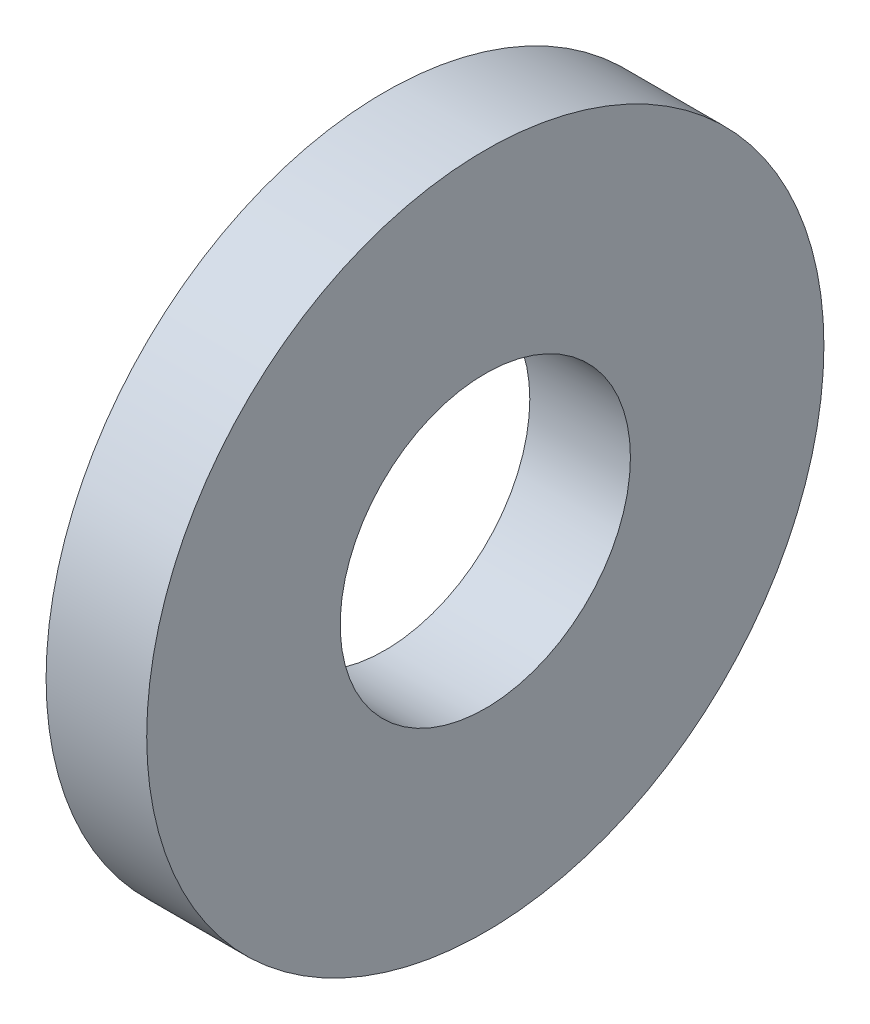
ISO-10303-21;
HEADER;
FILE_DESCRIPTION(('STEP AP214'),'2;1');
FILE_NAME('part.step','',(''),(''),'','','');
FILE_SCHEMA(('AUTOMOTIVE_DESIGN { 1 0 10303 214 1 1 1 1 }'));
ENDSEC;
DATA;
#1=APPLICATION_CONTEXT('core data for automotive mechanical design processes');
#2=APPLICATION_PROTOCOL_DEFINITION('international standard','automotive_design',2000,#1);
#3=PRODUCT_CONTEXT('',#1,'mechanical');
#4=PRODUCT('Part','Part','',(#3));
#5=PRODUCT_RELATED_PRODUCT_CATEGORY('part','',(#4));
#6=PRODUCT_DEFINITION_FORMATION('','',#4);
#7=PRODUCT_DEFINITION_CONTEXT('part definition',#1,'design');
#8=PRODUCT_DEFINITION('design','',#6,#7);
#9=PRODUCT_DEFINITION_SHAPE('','',#8);
#10=(LENGTH_UNIT() NAMED_UNIT(*) SI_UNIT(.MILLI.,.METRE.));
#11=(NAMED_UNIT(*) PLANE_ANGLE_UNIT() SI_UNIT($,.RADIAN.));
#12=(NAMED_UNIT(*) SI_UNIT($,.STERADIAN.) SOLID_ANGLE_UNIT());
#13=UNCERTAINTY_MEASURE_WITH_UNIT(LENGTH_MEASURE(1.E-05),#10,'distance_accuracy_value','');
#14=(GEOMETRIC_REPRESENTATION_CONTEXT(3) GLOBAL_UNCERTAINTY_ASSIGNED_CONTEXT((#13)) GLOBAL_UNIT_ASSIGNED_CONTEXT((#10,
#11,#12)) REPRESENTATION_CONTEXT('',''));
#15=CARTESIAN_POINT('',(0.,0.,0.));
#16=DIRECTION('',(0.,0.,1.));
#17=DIRECTION('',(1.,0.,0.));
#18=AXIS2_PLACEMENT_3D('',#15,#16,#17);
#19=CARTESIAN_POINT('',(1.6509999999999,-7.21644966006352E-13,-2.77555756156289E-13));
#20=DIRECTION('',(1.,0.,0.));
#21=DIRECTION('',(0.,0.,-1.));
#22=AXIS2_PLACEMENT_3D('',#19,#20,#21);
#23=PLANE('',#22);
#24=CARTESIAN_POINT('',(1.6509999999999,-7.21644966006352E-13,-2.77555756156289E-13));
#25=DIRECTION('',(1.,0.,0.));
#26=DIRECTION('',(0.,0.,-1.));
#27=AXIS2_PLACEMENT_3D('',#24,#25,#26);
#28=CIRCLE('',#27,5.55625);
#29=CARTESIAN_POINT('',(1.6509999999999,-7.18869061500094E-13,-5.55625000000029));
#30=VERTEX_POINT('',#29);
#31=EDGE_CURVE('E10',#30,#30,#28,.T.);
#32=ORIENTED_EDGE('',*,*,#31,.T.);
#33=EDGE_LOOP('',(#32));
#34=FACE_BOUND('',#33,.T.);
#35=CARTESIAN_POINT('',(1.6509999999999,-7.21644966006352E-13,-2.77555756156289E-13));
#36=DIRECTION('',(1.,0.,0.));
#37=DIRECTION('',(0.,0.,-1.));
#38=AXIS2_PLACEMENT_3D('',#35,#36,#37);
#39=CIRCLE('',#38,2.38125);
#40=CARTESIAN_POINT('',(1.6509999999999,-7.20455292646527E-13,-2.38125000000028));
#41=VERTEX_POINT('',#40);
#42=EDGE_CURVE('E43',#41,#41,#39,.T.);
#43=ORIENTED_EDGE('',*,*,#42,.F.);
#44=EDGE_LOOP('',(#43));
#45=FACE_BOUND('',#44,.T.);
#46=ADVANCED_FACE('F32',(#34,#45),#23,.T.);
#47=CARTESIAN_POINT('',(0.,0.,0.));
#48=DIRECTION('',(1.,0.,0.));
#49=DIRECTION('',(0.,0.,-1.));
#50=AXIS2_PLACEMENT_3D('',#47,#48,#49);
#51=PLANE('',#50);
#52=CARTESIAN_POINT('',(0.,0.,0.));
#53=DIRECTION('',(1.,0.,0.));
#54=DIRECTION('',(0.,0.,-1.));
#55=AXIS2_PLACEMENT_3D('',#52,#53,#54);
#56=CIRCLE('',#55,5.55625);
#57=CARTESIAN_POINT('',(0.,0.,-5.55625000000002));
#58=VERTEX_POINT('',#57);
#59=EDGE_CURVE('E36',#58,#58,#56,.T.);
#60=ORIENTED_EDGE('',*,*,#59,.F.);
#61=EDGE_LOOP('',(#60));
#62=FACE_BOUND('',#61,.T.);
#63=CARTESIAN_POINT('',(0.,0.,0.));
#64=DIRECTION('',(1.,0.,0.));
#65=DIRECTION('',(0.,0.,-1.));
#66=AXIS2_PLACEMENT_3D('',#63,#64,#65);
#67=CIRCLE('',#66,2.38125);
#68=CARTESIAN_POINT('',(0.,0.,-2.38125000000001));
#69=VERTEX_POINT('',#68);
#70=EDGE_CURVE('E45',#69,#69,#67,.T.);
#71=ORIENTED_EDGE('',*,*,#70,.T.);
#72=EDGE_LOOP('',(#71));
#73=FACE_BOUND('',#72,.T.);
#74=ADVANCED_FACE('F55',(#62,#73),#51,.F.);
#75=CARTESIAN_POINT('',(1.6509999999999,-7.21644966006352E-13,-2.77555756156289E-13));
#76=DIRECTION('',(-0.999999999999999,0.,0.));
#77=DIRECTION('',(0.,0.,1.));
#78=AXIS2_PLACEMENT_3D('',#75,#76,#77);
#79=CYLINDRICAL_SURFACE('',#78,5.55625);
#80=ORIENTED_EDGE('',*,*,#31,.F.);
#81=EDGE_LOOP('',(#80));
#82=FACE_BOUND('',#81,.T.);
#83=ORIENTED_EDGE('',*,*,#59,.T.);
#84=EDGE_LOOP('',(#83));
#85=FACE_BOUND('',#84,.T.);
#86=ADVANCED_FACE('F34',(#82,#85),#79,.T.);
#87=CARTESIAN_POINT('',(1.6509999999999,-7.21644966006352E-13,-2.77555756156289E-13));
#88=DIRECTION('',(-0.999999999999999,0.,0.));
#89=DIRECTION('',(0.,0.,1.));
#90=AXIS2_PLACEMENT_3D('',#87,#88,#89);
#91=CYLINDRICAL_SURFACE('',#90,2.38125);
#92=ORIENTED_EDGE('',*,*,#42,.T.);
#93=EDGE_LOOP('',(#92));
#94=FACE_BOUND('',#93,.T.);
#95=ORIENTED_EDGE('',*,*,#70,.F.);
#96=EDGE_LOOP('',(#95));
#97=FACE_BOUND('',#96,.T.);
#98=ADVANCED_FACE('F51',(#94,#97),#91,.F.);
#99=CLOSED_SHELL('',(#46,#74,#86,#98));
#100=MANIFOLD_SOLID_BREP('B2',#99);
#101=ADVANCED_BREP_SHAPE_REPRESENTATION('',(#18,#100),#14);
#102=SHAPE_DEFINITION_REPRESENTATION(#9,#101);
ENDSEC;
END-ISO-10303-21;
